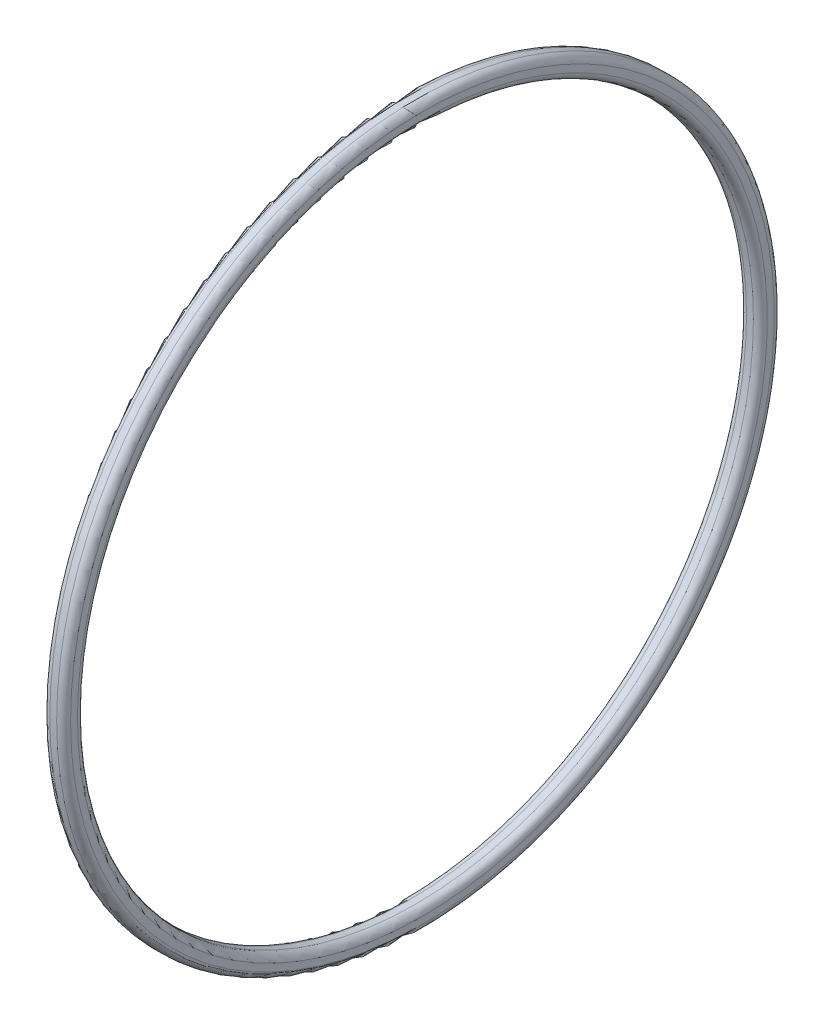
ISO-10303-21;
HEADER;
FILE_DESCRIPTION(('STEP AP214'),'2;1');
FILE_NAME('part.step','',(''),(''),'','','');
FILE_SCHEMA(('AUTOMOTIVE_DESIGN { 1 0 10303 214 1 1 1 1 }'));
ENDSEC;
DATA;
#1=APPLICATION_CONTEXT('core data for automotive mechanical design processes');
#2=APPLICATION_PROTOCOL_DEFINITION('international standard','automotive_design',2000,#1);
#3=PRODUCT_CONTEXT('',#1,'mechanical');
#4=PRODUCT('Part','Part','',(#3));
#5=PRODUCT_RELATED_PRODUCT_CATEGORY('part','',(#4));
#6=PRODUCT_DEFINITION_FORMATION('','',#4);
#7=PRODUCT_DEFINITION_CONTEXT('part definition',#1,'design');
#8=PRODUCT_DEFINITION('design','',#6,#7);
#9=PRODUCT_DEFINITION_SHAPE('','',#8);
#10=(LENGTH_UNIT() NAMED_UNIT(*) SI_UNIT(.MILLI.,.METRE.));
#11=(NAMED_UNIT(*) PLANE_ANGLE_UNIT() SI_UNIT($,.RADIAN.));
#12=(NAMED_UNIT(*) SI_UNIT($,.STERADIAN.) SOLID_ANGLE_UNIT());
#13=UNCERTAINTY_MEASURE_WITH_UNIT(LENGTH_MEASURE(1.E-05),#10,'distance_accuracy_value','');
#14=(GEOMETRIC_REPRESENTATION_CONTEXT(3) GLOBAL_UNCERTAINTY_ASSIGNED_CONTEXT((#13)) GLOBAL_UNIT_ASSIGNED_CONTEXT((#10,
#11,#12)) REPRESENTATION_CONTEXT('',''));
#15=CARTESIAN_POINT('',(0.,0.,0.));
#16=DIRECTION('',(0.,0.,1.));
#17=DIRECTION('',(1.,0.,0.));
#18=AXIS2_PLACEMENT_3D('',#15,#16,#17);
#19=CARTESIAN_POINT('',(0.5,0.,0.));
#20=DIRECTION('',(-1.,0.,0.));
#21=DIRECTION('',(0.,0.,1.));
#22=AXIS2_PLACEMENT_3D('',#19,#20,#21);
#23=TOROIDAL_SURFACE('',#22,50.75,1.);
#24=CARTESIAN_POINT('',(0.5,0.,0.));
#25=DIRECTION('',(-1.,0.,0.));
#26=DIRECTION('',(0.,0.,1.));
#27=AXIS2_PLACEMENT_3D('',#24,#25,#26);
#28=CIRCLE('',#27,51.75);
#29=CARTESIAN_POINT('',(0.5,0.,51.75));
#30=VERTEX_POINT('',#29);
#31=EDGE_CURVE('E59',#30,#30,#28,.T.);
#32=ORIENTED_EDGE('',*,*,#31,.F.);
#33=EDGE_LOOP('',(#32));
#34=FACE_BOUND('',#33,.T.);
#35=CARTESIAN_POINT('',(1.5,0.,0.));
#36=DIRECTION('',(-1.,0.,0.));
#37=DIRECTION('',(0.,0.,1.));
#38=AXIS2_PLACEMENT_3D('',#35,#36,#37);
#39=CIRCLE('',#38,50.75);
#40=CARTESIAN_POINT('',(1.5,0.,50.75));
#41=VERTEX_POINT('',#40);
#42=EDGE_CURVE('E10',#41,#41,#39,.T.);
#43=ORIENTED_EDGE('',*,*,#42,.T.);
#44=EDGE_LOOP('',(#43));
#45=FACE_BOUND('',#44,.T.);
#46=ADVANCED_FACE('F31',(#34,#45),#23,.T.);
#47=CARTESIAN_POINT('',(1.5,50.75,0.));
#48=DIRECTION('',(-1.,0.,0.));
#49=DIRECTION('',(0.,0.,1.));
#50=AXIS2_PLACEMENT_3D('',#47,#48,#49);
#51=PLANE('',#50);
#52=ORIENTED_EDGE('',*,*,#42,.F.);
#53=EDGE_LOOP('',(#52));
#54=FACE_BOUND('',#53,.T.);
#55=CARTESIAN_POINT('',(1.5,0.,0.));
#56=DIRECTION('',(-1.,0.,0.));
#57=DIRECTION('',(0.,0.,1.));
#58=AXIS2_PLACEMENT_3D('',#55,#56,#57);
#59=CIRCLE('',#58,49.75);
#60=CARTESIAN_POINT('',(1.5,0.,49.75));
#61=VERTEX_POINT('',#60);
#62=EDGE_CURVE('E37',#61,#61,#59,.T.);
#63=ORIENTED_EDGE('',*,*,#62,.T.);
#64=EDGE_LOOP('',(#63));
#65=FACE_BOUND('',#64,.T.);
#66=ADVANCED_FACE('F66',(#54,#65),#51,.F.);
#67=CARTESIAN_POINT('',(0.500000000000001,0.,0.));
#68=DIRECTION('',(-1.,0.,0.));
#69=DIRECTION('',(0.,0.,1.));
#70=AXIS2_PLACEMENT_3D('',#67,#68,#69);
#71=TOROIDAL_SURFACE('',#70,49.75,1.);
#72=ORIENTED_EDGE('',*,*,#62,.F.);
#73=EDGE_LOOP('',(#72));
#74=FACE_BOUND('',#73,.T.);
#75=CARTESIAN_POINT('',(0.500000000000001,0.,0.));
#76=DIRECTION('',(-1.,0.,0.));
#77=DIRECTION('',(0.,0.,1.));
#78=AXIS2_PLACEMENT_3D('',#75,#76,#77);
#79=CIRCLE('',#78,48.75);
#80=CARTESIAN_POINT('',(0.500000000000001,0.,48.75));
#81=VERTEX_POINT('',#80);
#82=EDGE_CURVE('E41',#81,#81,#79,.T.);
#83=ORIENTED_EDGE('',*,*,#82,.T.);
#84=EDGE_LOOP('',(#83));
#85=FACE_BOUND('',#84,.T.);
#86=ADVANCED_FACE('F70',(#74,#85),#71,.T.);
#87=CARTESIAN_POINT('',(0.,0.,0.));
#88=DIRECTION('',(-1.,0.,0.));
#89=DIRECTION('',(0.,0.,1.));
#90=AXIS2_PLACEMENT_3D('',#87,#88,#89);
#91=CYLINDRICAL_SURFACE('',#90,48.75);
#92=ORIENTED_EDGE('',*,*,#82,.F.);
#93=EDGE_LOOP('',(#92));
#94=FACE_BOUND('',#93,.T.);
#95=CARTESIAN_POINT('',(-0.5,0.,0.));
#96=DIRECTION('',(-1.,0.,0.));
#97=DIRECTION('',(0.,0.,1.));
#98=AXIS2_PLACEMENT_3D('',#95,#96,#97);
#99=CIRCLE('',#98,48.75);
#100=CARTESIAN_POINT('',(-0.5,0.,48.75));
#101=VERTEX_POINT('',#100);
#102=EDGE_CURVE('E45',#101,#101,#99,.T.);
#103=ORIENTED_EDGE('',*,*,#102,.T.);
#104=EDGE_LOOP('',(#103));
#105=FACE_BOUND('',#104,.T.);
#106=ADVANCED_FACE('F75',(#94,#105),#91,.F.);
#107=CARTESIAN_POINT('',(-0.499999999999999,0.,0.));
#108=DIRECTION('',(-1.,0.,0.));
#109=DIRECTION('',(0.,0.,1.));
#110=AXIS2_PLACEMENT_3D('',#107,#108,#109);
#111=TOROIDAL_SURFACE('',#110,49.75,1.);
#112=ORIENTED_EDGE('',*,*,#102,.F.);
#113=EDGE_LOOP('',(#112));
#114=FACE_BOUND('',#113,.T.);
#115=CARTESIAN_POINT('',(-1.5,0.,0.));
#116=DIRECTION('',(-1.,0.,0.));
#117=DIRECTION('',(0.,0.,1.));
#118=AXIS2_PLACEMENT_3D('',#115,#116,#117);
#119=CIRCLE('',#118,49.75);
#120=CARTESIAN_POINT('',(-1.5,0.,49.75));
#121=VERTEX_POINT('',#120);
#122=EDGE_CURVE('E50',#121,#121,#119,.T.);
#123=ORIENTED_EDGE('',*,*,#122,.T.);
#124=EDGE_LOOP('',(#123));
#125=FACE_BOUND('',#124,.T.);
#126=ADVANCED_FACE('F81',(#114,#125),#111,.T.);
#127=CARTESIAN_POINT('',(-1.5,50.75,0.));
#128=DIRECTION('',(1.,0.,0.));
#129=DIRECTION('',(0.,0.,-1.));
#130=AXIS2_PLACEMENT_3D('',#127,#128,#129);
#131=PLANE('',#130);
#132=ORIENTED_EDGE('',*,*,#122,.F.);
#133=EDGE_LOOP('',(#132));
#134=FACE_BOUND('',#133,.T.);
#135=CARTESIAN_POINT('',(-1.5,0.,0.));
#136=DIRECTION('',(-1.,0.,0.));
#137=DIRECTION('',(0.,0.,1.));
#138=AXIS2_PLACEMENT_3D('',#135,#136,#137);
#139=CIRCLE('',#138,50.75);
#140=CARTESIAN_POINT('',(-1.5,0.,50.75));
#141=VERTEX_POINT('',#140);
#142=EDGE_CURVE('E53',#141,#141,#139,.T.);
#143=ORIENTED_EDGE('',*,*,#142,.T.);
#144=EDGE_LOOP('',(#143));
#145=FACE_BOUND('',#144,.T.);
#146=ADVANCED_FACE('F85',(#134,#145),#131,.F.);
#147=CARTESIAN_POINT('',(-0.5,0.,0.));
#148=DIRECTION('',(-1.,0.,0.));
#149=DIRECTION('',(0.,0.,1.));
#150=AXIS2_PLACEMENT_3D('',#147,#148,#149);
#151=TOROIDAL_SURFACE('',#150,50.75,1.);
#152=ORIENTED_EDGE('',*,*,#142,.F.);
#153=EDGE_LOOP('',(#152));
#154=FACE_BOUND('',#153,.T.);
#155=CARTESIAN_POINT('',(-0.5,0.,0.));
#156=DIRECTION('',(-1.,0.,0.));
#157=DIRECTION('',(0.,0.,1.));
#158=AXIS2_PLACEMENT_3D('',#155,#156,#157);
#159=CIRCLE('',#158,51.75);
#160=CARTESIAN_POINT('',(-0.5,0.,51.75));
#161=VERTEX_POINT('',#160);
#162=EDGE_CURVE('E56',#161,#161,#159,.T.);
#163=ORIENTED_EDGE('',*,*,#162,.T.);
#164=EDGE_LOOP('',(#163));
#165=FACE_BOUND('',#164,.T.);
#166=ADVANCED_FACE('F89',(#154,#165),#151,.T.);
#167=CARTESIAN_POINT('',(0.,0.,0.));
#168=DIRECTION('',(-1.,0.,0.));
#169=DIRECTION('',(0.,0.,1.));
#170=AXIS2_PLACEMENT_3D('',#167,#168,#169);
#171=CYLINDRICAL_SURFACE('',#170,51.75);
#172=ORIENTED_EDGE('',*,*,#162,.F.);
#173=EDGE_LOOP('',(#172));
#174=FACE_BOUND('',#173,.T.);
#175=ORIENTED_EDGE('',*,*,#31,.T.);
#176=EDGE_LOOP('',(#175));
#177=FACE_BOUND('',#176,.T.);
#178=ADVANCED_FACE('F63',(#174,#177),#171,.T.);
#179=CLOSED_SHELL('',(#46,#66,#86,#106,#126,#146,#166,#178));
#180=MANIFOLD_SOLID_BREP('B2',#179);
#181=ADVANCED_BREP_SHAPE_REPRESENTATION('',(#18,#180),#14);
#182=SHAPE_DEFINITION_REPRESENTATION(#9,#181);
ENDSEC;
END-ISO-10303-21;
